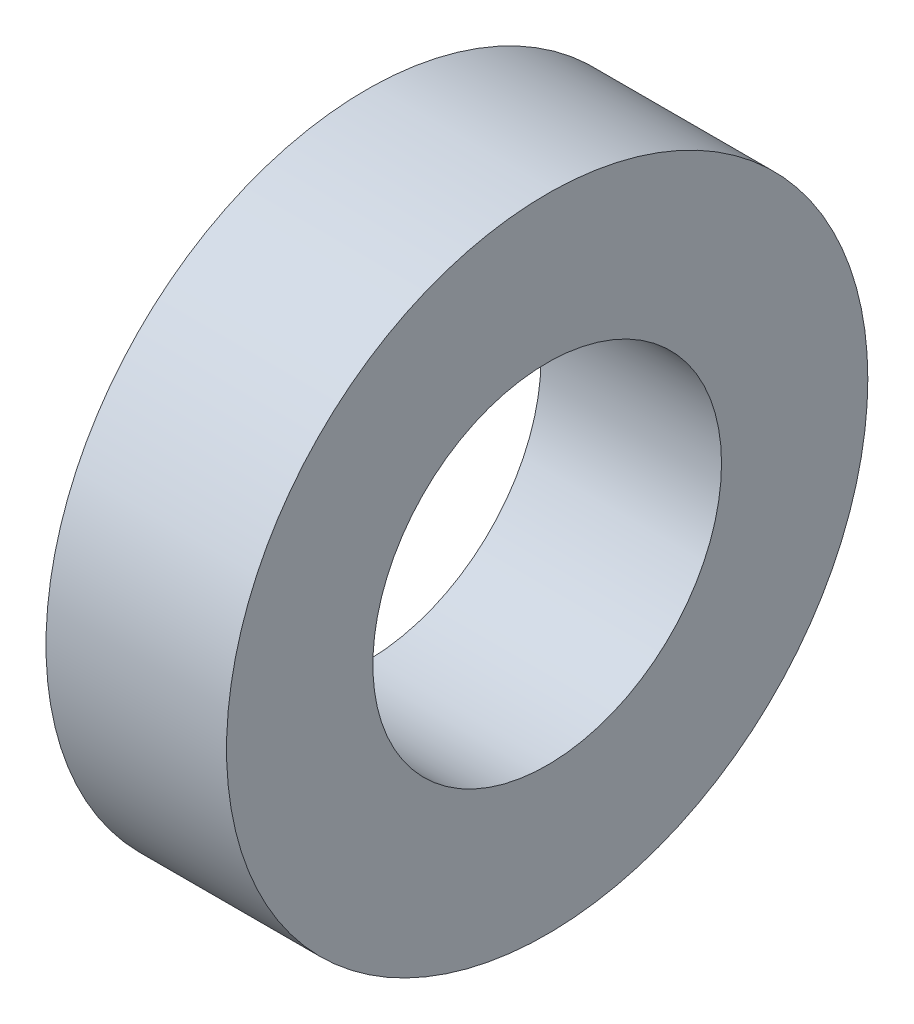
ISO-10303-21;
HEADER;
FILE_DESCRIPTION(('STEP AP214'),'2;1');
FILE_NAME('part.step','',(''),(''),'','','');
FILE_SCHEMA(('AUTOMOTIVE_DESIGN { 1 0 10303 214 1 1 1 1 }'));
ENDSEC;
DATA;
#1=APPLICATION_CONTEXT('core data for automotive mechanical design processes');
#2=APPLICATION_PROTOCOL_DEFINITION('international standard','automotive_design',2000,#1);
#3=PRODUCT_CONTEXT('',#1,'mechanical');
#4=PRODUCT('Part','Part','',(#3));
#5=PRODUCT_RELATED_PRODUCT_CATEGORY('part','',(#4));
#6=PRODUCT_DEFINITION_FORMATION('','',#4);
#7=PRODUCT_DEFINITION_CONTEXT('part definition',#1,'design');
#8=PRODUCT_DEFINITION('design','',#6,#7);
#9=PRODUCT_DEFINITION_SHAPE('','',#8);
#10=(LENGTH_UNIT() NAMED_UNIT(*) SI_UNIT(.MILLI.,.METRE.));
#11=(NAMED_UNIT(*) PLANE_ANGLE_UNIT() SI_UNIT($,.RADIAN.));
#12=(NAMED_UNIT(*) SI_UNIT($,.STERADIAN.) SOLID_ANGLE_UNIT());
#13=UNCERTAINTY_MEASURE_WITH_UNIT(LENGTH_MEASURE(1.E-05),#10,'distance_accuracy_value','');
#14=(GEOMETRIC_REPRESENTATION_CONTEXT(3) GLOBAL_UNCERTAINTY_ASSIGNED_CONTEXT((#13)) GLOBAL_UNIT_ASSIGNED_CONTEXT((#10,
#11,#12)) REPRESENTATION_CONTEXT('',''));
#15=CARTESIAN_POINT('',(0.,0.,0.));
#16=DIRECTION('',(0.,0.,1.));
#17=DIRECTION('',(1.,0.,0.));
#18=AXIS2_PLACEMENT_3D('',#15,#16,#17);
#19=CARTESIAN_POINT('',(1.4732,0.,0.));
#20=DIRECTION('',(1.,0.,0.));
#21=DIRECTION('',(0.,0.,-1.));
#22=AXIS2_PLACEMENT_3D('',#19,#20,#21);
#23=PLANE('',#22);
#24=CARTESIAN_POINT('',(1.4732,0.,0.));
#25=DIRECTION('',(1.,0.,0.));
#26=DIRECTION('',(0.,0.,-1.));
#27=AXIS2_PLACEMENT_3D('',#24,#25,#26);
#28=CIRCLE('',#27,2.6162);
#29=CARTESIAN_POINT('',(1.4732,0.,-2.6162));
#30=VERTEX_POINT('',#29);
#31=EDGE_CURVE('E10',#30,#30,#28,.T.);
#32=ORIENTED_EDGE('',*,*,#31,.T.);
#33=EDGE_LOOP('',(#32));
#34=FACE_BOUND('',#33,.T.);
#35=CARTESIAN_POINT('',(1.4732,0.,0.));
#36=DIRECTION('',(1.,0.,0.));
#37=DIRECTION('',(0.,0.,-1.));
#38=AXIS2_PLACEMENT_3D('',#35,#36,#37);
#39=CIRCLE('',#38,1.4224);
#40=CARTESIAN_POINT('',(1.4732,0.,-1.4224));
#41=VERTEX_POINT('',#40);
#42=EDGE_CURVE('E49',#41,#41,#39,.T.);
#43=ORIENTED_EDGE('',*,*,#42,.F.);
#44=EDGE_LOOP('',(#43));
#45=FACE_BOUND('',#44,.T.);
#46=ADVANCED_FACE('F34',(#34,#45),#23,.T.);
#47=CARTESIAN_POINT('',(0.,0.,0.));
#48=DIRECTION('',(1.,0.,0.));
#49=DIRECTION('',(0.,0.,-1.));
#50=AXIS2_PLACEMENT_3D('',#47,#48,#49);
#51=PLANE('',#50);
#52=CARTESIAN_POINT('',(0.,0.,0.));
#53=DIRECTION('',(1.,0.,0.));
#54=DIRECTION('',(0.,0.,-1.));
#55=AXIS2_PLACEMENT_3D('',#52,#53,#54);
#56=CIRCLE('',#55,2.6162);
#57=CARTESIAN_POINT('',(0.,0.,-2.6162));
#58=VERTEX_POINT('',#57);
#59=EDGE_CURVE('E38',#58,#58,#56,.T.);
#60=ORIENTED_EDGE('',*,*,#59,.F.);
#61=EDGE_LOOP('',(#60));
#62=FACE_BOUND('',#61,.T.);
#63=CARTESIAN_POINT('',(0.,0.,0.));
#64=DIRECTION('',(1.,0.,0.));
#65=DIRECTION('',(0.,0.,-1.));
#66=AXIS2_PLACEMENT_3D('',#63,#64,#65);
#67=CIRCLE('',#66,1.4224);
#68=CARTESIAN_POINT('',(0.,0.,-1.4224));
#69=VERTEX_POINT('',#68);
#70=EDGE_CURVE('E51',#69,#69,#67,.T.);
#71=ORIENTED_EDGE('',*,*,#70,.T.);
#72=EDGE_LOOP('',(#71));
#73=FACE_BOUND('',#72,.T.);
#74=ADVANCED_FACE('F61',(#62,#73),#51,.F.);
#75=CARTESIAN_POINT('',(1.4732,0.,0.));
#76=DIRECTION('',(-1.,0.,0.));
#77=DIRECTION('',(0.,0.,1.));
#78=AXIS2_PLACEMENT_3D('',#75,#76,#77);
#79=CYLINDRICAL_SURFACE('',#78,2.6162);
#80=ORIENTED_EDGE('',*,*,#31,.F.);
#81=EDGE_LOOP('',(#80));
#82=FACE_BOUND('',#81,.T.);
#83=ORIENTED_EDGE('',*,*,#59,.T.);
#84=EDGE_LOOP('',(#83));
#85=FACE_BOUND('',#84,.T.);
#86=ADVANCED_FACE('F36',(#82,#85),#79,.T.);
#87=CARTESIAN_POINT('',(1.4732,0.,0.));
#88=DIRECTION('',(-1.,0.,0.));
#89=DIRECTION('',(0.,0.,1.));
#90=AXIS2_PLACEMENT_3D('',#87,#88,#89);
#91=CYLINDRICAL_SURFACE('',#90,1.4224);
#92=ORIENTED_EDGE('',*,*,#42,.T.);
#93=EDGE_LOOP('',(#92));
#94=FACE_BOUND('',#93,.T.);
#95=ORIENTED_EDGE('',*,*,#70,.F.);
#96=EDGE_LOOP('',(#95));
#97=FACE_BOUND('',#96,.T.);
#98=ADVANCED_FACE('F57',(#94,#97),#91,.F.);
#99=CLOSED_SHELL('',(#46,#74,#86,#98));
#100=MANIFOLD_SOLID_BREP('B2',#99);
#101=ADVANCED_BREP_SHAPE_REPRESENTATION('',(#18,#100),#14);
#102=SHAPE_DEFINITION_REPRESENTATION(#9,#101);
ENDSEC;
END-ISO-10303-21;
